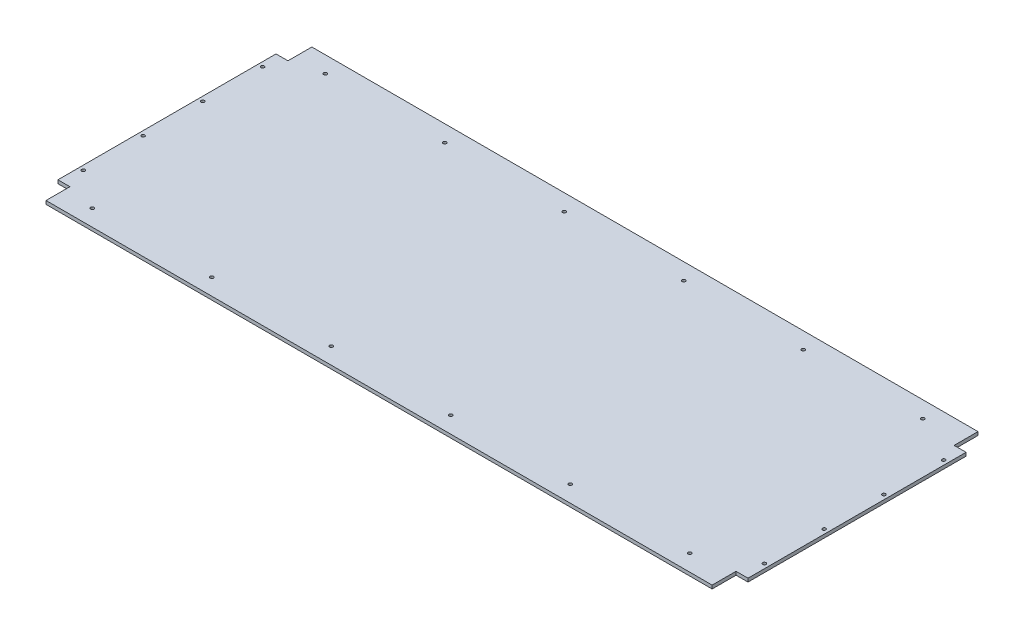
ISO-10303-21;
HEADER;
FILE_DESCRIPTION(('STEP AP214'),'2;1');
FILE_NAME('part.step','',(''),(''),'','','');
FILE_SCHEMA(('AUTOMOTIVE_DESIGN { 1 0 10303 214 1 1 1 1 }'));
ENDSEC;
DATA;
#1=APPLICATION_CONTEXT('core data for automotive mechanical design processes');
#2=APPLICATION_PROTOCOL_DEFINITION('international standard','automotive_design',2000,#1);
#3=PRODUCT_CONTEXT('',#1,'mechanical');
#4=PRODUCT('Part','Part','',(#3));
#5=PRODUCT_RELATED_PRODUCT_CATEGORY('part','',(#4));
#6=PRODUCT_DEFINITION_FORMATION('','',#4);
#7=PRODUCT_DEFINITION_CONTEXT('part definition',#1,'design');
#8=PRODUCT_DEFINITION('design','',#6,#7);
#9=PRODUCT_DEFINITION_SHAPE('','',#8);
#10=(LENGTH_UNIT() NAMED_UNIT(*) SI_UNIT(.MILLI.,.METRE.));
#11=(NAMED_UNIT(*) PLANE_ANGLE_UNIT() SI_UNIT($,.RADIAN.));
#12=(NAMED_UNIT(*) SI_UNIT($,.STERADIAN.) SOLID_ANGLE_UNIT());
#13=UNCERTAINTY_MEASURE_WITH_UNIT(LENGTH_MEASURE(1.E-05),#10,'distance_accuracy_value','');
#14=(GEOMETRIC_REPRESENTATION_CONTEXT(3) GLOBAL_UNCERTAINTY_ASSIGNED_CONTEXT((#13)) GLOBAL_UNIT_ASSIGNED_CONTEXT((#10,
#11,#12)) REPRESENTATION_CONTEXT('',''));
#15=CARTESIAN_POINT('',(0.,0.,0.));
#16=DIRECTION('',(0.,0.,1.));
#17=DIRECTION('',(1.,0.,0.));
#18=AXIS2_PLACEMENT_3D('',#15,#16,#17);
#19=CARTESIAN_POINT('',(-577.5,5.715,-222.5));
#20=DIRECTION('',(1.,0.,0.));
#21=DIRECTION('',(0.,0.,-1.));
#22=AXIS2_PLACEMENT_3D('',#19,#20,#21);
#23=PLANE('',#22);
#24=DIRECTION('',(0.,0.,1.));
#25=VECTOR('',#24,1.);
#26=CARTESIAN_POINT('',(-577.5,0.,-222.5));
#27=LINE('',#26,#25);
#28=CARTESIAN_POINT('',(-577.5,0.,-182.5));
#29=VERTEX_POINT('',#28);
#30=CARTESIAN_POINT('',(-577.5,0.,182.5));
#31=VERTEX_POINT('',#30);
#32=EDGE_CURVE('E144',#29,#31,#27,.T.);
#33=ORIENTED_EDGE('',*,*,#32,.T.);
#34=DIRECTION('',(0.,1.,0.));
#35=VECTOR('',#34,1.);
#36=CARTESIAN_POINT('',(-577.5,0.,182.5));
#37=LINE('',#36,#35);
#38=CARTESIAN_POINT('',(-577.5,5.715,182.5));
#39=VERTEX_POINT('',#38);
#40=EDGE_CURVE('E171',#31,#39,#37,.T.);
#41=ORIENTED_EDGE('',*,*,#40,.T.);
#42=DIRECTION('',(0.,0.,1.));
#43=VECTOR('',#42,1.);
#44=CARTESIAN_POINT('',(-577.5,5.715,-222.5));
#45=LINE('',#44,#43);
#46=CARTESIAN_POINT('',(-577.5,5.715,-182.5));
#47=VERTEX_POINT('',#46);
#48=EDGE_CURVE('E154',#47,#39,#45,.T.);
#49=ORIENTED_EDGE('',*,*,#48,.F.);
#50=DIRECTION('',(0.,1.,0.));
#51=VECTOR('',#50,1.);
#52=CARTESIAN_POINT('',(-577.5,0.,-182.5));
#53=LINE('',#52,#51);
#54=EDGE_CURVE('E157',#29,#47,#53,.T.);
#55=ORIENTED_EDGE('',*,*,#54,.F.);
#56=EDGE_LOOP('',(#33,#41,#49,#55));
#57=FACE_BOUND('',#56,.T.);
#58=ADVANCED_FACE('F33',(#57),#23,.F.);
#59=CARTESIAN_POINT('',(-577.5,5.715,222.5));
#60=DIRECTION('',(0.,0.,-1.));
#61=DIRECTION('',(-1.,0.,0.));
#62=AXIS2_PLACEMENT_3D('',#59,#60,#61);
#63=PLANE('',#62);
#64=DIRECTION('',(1.,0.,0.));
#65=VECTOR('',#64,1.);
#66=CARTESIAN_POINT('',(-577.5,5.715,222.5));
#67=LINE('',#66,#65);
#68=CARTESIAN_POINT('',(-557.5,5.715,222.5));
#69=VERTEX_POINT('',#68);
#70=CARTESIAN_POINT('',(557.5,5.715,222.5));
#71=VERTEX_POINT('',#70);
#72=EDGE_CURVE('E139',#69,#71,#67,.T.);
#73=ORIENTED_EDGE('',*,*,#72,.F.);
#74=DIRECTION('',(0.,1.,0.));
#75=VECTOR('',#74,1.);
#76=CARTESIAN_POINT('',(-557.5,0.,222.5));
#77=LINE('',#76,#75);
#78=CARTESIAN_POINT('',(-557.5,0.,222.5));
#79=VERTEX_POINT('',#78);
#80=EDGE_CURVE('E125',#79,#69,#77,.T.);
#81=ORIENTED_EDGE('',*,*,#80,.F.);
#82=DIRECTION('',(1.,0.,0.));
#83=VECTOR('',#82,1.);
#84=CARTESIAN_POINT('',(-577.5,0.,222.5));
#85=LINE('',#84,#83);
#86=CARTESIAN_POINT('',(557.5,0.,222.5));
#87=VERTEX_POINT('',#86);
#88=EDGE_CURVE('E137',#79,#87,#85,.T.);
#89=ORIENTED_EDGE('',*,*,#88,.T.);
#90=DIRECTION('',(0.,1.,0.));
#91=VECTOR('',#90,1.);
#92=CARTESIAN_POINT('',(557.5,0.,222.5));
#93=LINE('',#92,#91);
#94=EDGE_CURVE('E200',#87,#71,#93,.T.);
#95=ORIENTED_EDGE('',*,*,#94,.T.);
#96=EDGE_LOOP('',(#73,#81,#89,#95));
#97=FACE_BOUND('',#96,.T.);
#98=ADVANCED_FACE('F135',(#97),#63,.F.);
#99=CARTESIAN_POINT('',(577.5,5.715,-222.5));
#100=DIRECTION('',(-1.,0.,0.));
#101=DIRECTION('',(0.,0.,1.));
#102=AXIS2_PLACEMENT_3D('',#99,#100,#101);
#103=PLANE('',#102);
#104=DIRECTION('',(0.,0.,-1.));
#105=VECTOR('',#104,1.);
#106=CARTESIAN_POINT('',(577.5,5.715,-222.5));
#107=LINE('',#106,#105);
#108=CARTESIAN_POINT('',(577.5,5.715,182.5));
#109=VERTEX_POINT('',#108);
#110=CARTESIAN_POINT('',(577.5,5.715,-182.5));
#111=VERTEX_POINT('',#110);
#112=EDGE_CURVE('E41',#109,#111,#107,.T.);
#113=ORIENTED_EDGE('',*,*,#112,.F.);
#114=DIRECTION('',(0.,1.,0.));
#115=VECTOR('',#114,1.);
#116=CARTESIAN_POINT('',(577.5,0.,182.5));
#117=LINE('',#116,#115);
#118=CARTESIAN_POINT('',(577.5,0.,182.5));
#119=VERTEX_POINT('',#118);
#120=EDGE_CURVE('E196',#119,#109,#117,.T.);
#121=ORIENTED_EDGE('',*,*,#120,.F.);
#122=DIRECTION('',(0.,0.,-1.));
#123=VECTOR('',#122,1.);
#124=CARTESIAN_POINT('',(577.5,0.,-222.5));
#125=LINE('',#124,#123);
#126=CARTESIAN_POINT('',(577.5,0.,-182.5));
#127=VERTEX_POINT('',#126);
#128=EDGE_CURVE('E143',#119,#127,#125,.T.);
#129=ORIENTED_EDGE('',*,*,#128,.T.);
#130=DIRECTION('',(0.,1.,0.));
#131=VECTOR('',#130,1.);
#132=CARTESIAN_POINT('',(577.5,0.,-182.5));
#133=LINE('',#132,#131);
#134=EDGE_CURVE('E181',#127,#111,#133,.T.);
#135=ORIENTED_EDGE('',*,*,#134,.T.);
#136=EDGE_LOOP('',(#113,#121,#129,#135));
#137=FACE_BOUND('',#136,.T.);
#138=ADVANCED_FACE('F408',(#137),#103,.F.);
#139=CARTESIAN_POINT('',(-577.5,5.715,-222.5));
#140=DIRECTION('',(0.,0.,1.));
#141=DIRECTION('',(1.,0.,0.));
#142=AXIS2_PLACEMENT_3D('',#139,#140,#141);
#143=PLANE('',#142);
#144=DIRECTION('',(-1.,0.,0.));
#145=VECTOR('',#144,1.);
#146=CARTESIAN_POINT('',(-577.5,5.715,-222.5));
#147=LINE('',#146,#145);
#148=CARTESIAN_POINT('',(557.5,5.715,-222.5));
#149=VERTEX_POINT('',#148);
#150=CARTESIAN_POINT('',(-557.5,5.715,-222.5));
#151=VERTEX_POINT('',#150);
#152=EDGE_CURVE('E11',#149,#151,#147,.T.);
#153=ORIENTED_EDGE('',*,*,#152,.F.);
#154=DIRECTION('',(0.,1.,0.));
#155=VECTOR('',#154,1.);
#156=CARTESIAN_POINT('',(557.5,0.,-222.5));
#157=LINE('',#156,#155);
#158=CARTESIAN_POINT('',(557.5,0.,-222.5));
#159=VERTEX_POINT('',#158);
#160=EDGE_CURVE('E176',#159,#149,#157,.T.);
#161=ORIENTED_EDGE('',*,*,#160,.F.);
#162=DIRECTION('',(-1.,0.,0.));
#163=VECTOR('',#162,1.);
#164=CARTESIAN_POINT('',(-577.5,0.,-222.5));
#165=LINE('',#164,#163);
#166=CARTESIAN_POINT('',(-557.5,0.,-222.5));
#167=VERTEX_POINT('',#166);
#168=EDGE_CURVE('E36',#159,#167,#165,.T.);
#169=ORIENTED_EDGE('',*,*,#168,.T.);
#170=DIRECTION('',(0.,1.,0.));
#171=VECTOR('',#170,1.);
#172=CARTESIAN_POINT('',(-557.5,0.,-222.5));
#173=LINE('',#172,#171);
#174=EDGE_CURVE('E148',#167,#151,#173,.T.);
#175=ORIENTED_EDGE('',*,*,#174,.T.);
#176=EDGE_LOOP('',(#153,#161,#169,#175));
#177=FACE_BOUND('',#176,.T.);
#178=ADVANCED_FACE('F349',(#177),#143,.F.);
#179=CARTESIAN_POINT('',(0.,5.715,0.));
#180=DIRECTION('',(0.,1.,0.));
#181=DIRECTION('',(0.,0.,1.));
#182=AXIS2_PLACEMENT_3D('',#179,#180,#181);
#183=PLANE('',#182);
#184=CARTESIAN_POINT('',(492.5,5.715,195.));
#185=DIRECTION('',(0.,1.,0.));
#186=DIRECTION('',(0.,0.,-1.));
#187=AXIS2_PLACEMENT_3D('',#184,#185,#186);
#188=CIRCLE('',#187,2.75000000000004);
#189=CARTESIAN_POINT('',(492.5,5.715,192.25));
#190=VERTEX_POINT('',#189);
#191=EDGE_CURVE('E301',#190,#190,#188,.T.);
#192=ORIENTED_EDGE('',*,*,#191,.F.);
#193=EDGE_LOOP('',(#192));
#194=FACE_BOUND('',#193,.T.);
#195=CARTESIAN_POINT('',(292.5,5.715,195.));
#196=DIRECTION('',(0.,1.,0.));
#197=DIRECTION('',(0.,0.,-1.));
#198=AXIS2_PLACEMENT_3D('',#195,#196,#197);
#199=CIRCLE('',#198,2.75000000000004);
#200=CARTESIAN_POINT('',(292.5,5.715,192.25));
#201=VERTEX_POINT('',#200);
#202=EDGE_CURVE('E295',#201,#201,#199,.T.);
#203=ORIENTED_EDGE('',*,*,#202,.F.);
#204=EDGE_LOOP('',(#203));
#205=FACE_BOUND('',#204,.T.);
#206=CARTESIAN_POINT('',(92.5,5.715,195.));
#207=DIRECTION('',(0.,1.,0.));
#208=DIRECTION('',(0.,0.,-1.));
#209=AXIS2_PLACEMENT_3D('',#206,#207,#208);
#210=CIRCLE('',#209,2.75000000000002);
#211=CARTESIAN_POINT('',(92.5,5.715,192.25));
#212=VERTEX_POINT('',#211);
#213=EDGE_CURVE('E289',#212,#212,#210,.T.);
#214=ORIENTED_EDGE('',*,*,#213,.F.);
#215=EDGE_LOOP('',(#214));
#216=FACE_BOUND('',#215,.T.);
#217=CARTESIAN_POINT('',(-107.5,5.715,195.));
#218=DIRECTION('',(0.,1.,0.));
#219=DIRECTION('',(0.,0.,-1.));
#220=AXIS2_PLACEMENT_3D('',#217,#218,#219);
#221=CIRCLE('',#220,2.75000000000002);
#222=CARTESIAN_POINT('',(-107.5,5.715,192.25));
#223=VERTEX_POINT('',#222);
#224=EDGE_CURVE('E283',#223,#223,#221,.T.);
#225=ORIENTED_EDGE('',*,*,#224,.F.);
#226=EDGE_LOOP('',(#225));
#227=FACE_BOUND('',#226,.T.);
#228=CARTESIAN_POINT('',(-307.5,5.715,195.));
#229=DIRECTION('',(0.,1.,0.));
#230=DIRECTION('',(0.,0.,-1.));
#231=AXIS2_PLACEMENT_3D('',#228,#229,#230);
#232=CIRCLE('',#231,2.75000000000004);
#233=CARTESIAN_POINT('',(-307.5,5.715,192.25));
#234=VERTEX_POINT('',#233);
#235=EDGE_CURVE('E276',#234,#234,#232,.T.);
#236=ORIENTED_EDGE('',*,*,#235,.F.);
#237=EDGE_LOOP('',(#236));
#238=FACE_BOUND('',#237,.T.);
#239=CARTESIAN_POINT('',(-507.5,5.715,195.));
#240=DIRECTION('',(0.,1.,0.));
#241=DIRECTION('',(0.,0.,-1.));
#242=AXIS2_PLACEMENT_3D('',#239,#240,#241);
#243=CIRCLE('',#242,2.75000000000004);
#244=CARTESIAN_POINT('',(-507.5,5.715,192.25));
#245=VERTEX_POINT('',#244);
#246=EDGE_CURVE('E330',#245,#245,#243,.T.);
#247=ORIENTED_EDGE('',*,*,#246,.F.);
#248=EDGE_LOOP('',(#247));
#249=FACE_BOUND('',#248,.T.);
#250=CARTESIAN_POINT('',(569.999999999997,5.715,147.5));
#251=DIRECTION('',(0.,1.,0.));
#252=DIRECTION('',(0.,0.,-1.));
#253=AXIS2_PLACEMENT_3D('',#250,#251,#252);
#254=CIRCLE('',#253,2.75000000000004);
#255=CARTESIAN_POINT('',(569.999999999997,5.715,144.75));
#256=VERTEX_POINT('',#255);
#257=EDGE_CURVE('E324',#256,#256,#254,.T.);
#258=ORIENTED_EDGE('',*,*,#257,.F.);
#259=EDGE_LOOP('',(#258));
#260=FACE_BOUND('',#259,.T.);
#261=CARTESIAN_POINT('',(569.999999999998,5.715,47.4999999999999));
#262=DIRECTION('',(0.,1.,0.));
#263=DIRECTION('',(0.,0.,-1.));
#264=AXIS2_PLACEMENT_3D('',#261,#262,#263);
#265=CIRCLE('',#264,2.75000000000004);
#266=CARTESIAN_POINT('',(569.999999999998,5.715,44.7499999999999));
#267=VERTEX_POINT('',#266);
#268=EDGE_CURVE('E318',#267,#267,#265,.T.);
#269=ORIENTED_EDGE('',*,*,#268,.F.);
#270=EDGE_LOOP('',(#269));
#271=FACE_BOUND('',#270,.T.);
#272=CARTESIAN_POINT('',(569.999999999999,5.715,-52.5000000000001));
#273=DIRECTION('',(0.,1.,0.));
#274=DIRECTION('',(0.,0.,-1.));
#275=AXIS2_PLACEMENT_3D('',#272,#273,#274);
#276=CIRCLE('',#275,2.75000000000004);
#277=CARTESIAN_POINT('',(569.999999999999,5.715,-55.2500000000001));
#278=VERTEX_POINT('',#277);
#279=EDGE_CURVE('E312',#278,#278,#276,.T.);
#280=ORIENTED_EDGE('',*,*,#279,.F.);
#281=EDGE_LOOP('',(#280));
#282=FACE_BOUND('',#281,.T.);
#283=CARTESIAN_POINT('',(570.,5.715,-152.5));
#284=DIRECTION('',(0.,1.,0.));
#285=DIRECTION('',(0.,0.,-1.));
#286=AXIS2_PLACEMENT_3D('',#283,#284,#285);
#287=CIRCLE('',#286,2.75000000000004);
#288=CARTESIAN_POINT('',(570.,5.715,-155.25));
#289=VERTEX_POINT('',#288);
#290=EDGE_CURVE('E306',#289,#289,#287,.T.);
#291=ORIENTED_EDGE('',*,*,#290,.F.);
#292=EDGE_LOOP('',(#291));
#293=FACE_BOUND('',#292,.T.);
#294=CARTESIAN_POINT('',(-570.,5.715,-152.5));
#295=DIRECTION('',(0.,1.,0.));
#296=DIRECTION('',(0.,0.,1.));
#297=AXIS2_PLACEMENT_3D('',#294,#295,#296);
#298=CIRCLE('',#297,2.75000000000004);
#299=CARTESIAN_POINT('',(-570.,5.715,-149.75));
#300=VERTEX_POINT('',#299);
#301=EDGE_CURVE('E241',#300,#300,#298,.T.);
#302=ORIENTED_EDGE('',*,*,#301,.F.);
#303=EDGE_LOOP('',(#302));
#304=FACE_BOUND('',#303,.T.);
#305=CARTESIAN_POINT('',(-307.5,5.715,-195.));
#306=DIRECTION('',(0.,1.,0.));
#307=DIRECTION('',(0.,0.,1.));
#308=AXIS2_PLACEMENT_3D('',#305,#306,#307);
#309=CIRCLE('',#308,2.75000000000004);
#310=CARTESIAN_POINT('',(-307.5,5.715,-192.25));
#311=VERTEX_POINT('',#310);
#312=EDGE_CURVE('E235',#311,#311,#309,.T.);
#313=ORIENTED_EDGE('',*,*,#312,.F.);
#314=EDGE_LOOP('',(#313));
#315=FACE_BOUND('',#314,.T.);
#316=CARTESIAN_POINT('',(-107.5,5.715,-195.));
#317=DIRECTION('',(0.,1.,0.));
#318=DIRECTION('',(0.,0.,1.));
#319=AXIS2_PLACEMENT_3D('',#316,#317,#318);
#320=CIRCLE('',#319,2.75000000000002);
#321=CARTESIAN_POINT('',(-107.5,5.715,-192.25));
#322=VERTEX_POINT('',#321);
#323=EDGE_CURVE('E229',#322,#322,#320,.T.);
#324=ORIENTED_EDGE('',*,*,#323,.F.);
#325=EDGE_LOOP('',(#324));
#326=FACE_BOUND('',#325,.T.);
#327=CARTESIAN_POINT('',(92.5,5.715,-195.));
#328=DIRECTION('',(0.,1.,0.));
#329=DIRECTION('',(0.,0.,1.));
#330=AXIS2_PLACEMENT_3D('',#327,#328,#329);
#331=CIRCLE('',#330,2.75000000000002);
#332=CARTESIAN_POINT('',(92.5,5.715,-192.25));
#333=VERTEX_POINT('',#332);
#334=EDGE_CURVE('E222',#333,#333,#331,.T.);
#335=ORIENTED_EDGE('',*,*,#334,.F.);
#336=EDGE_LOOP('',(#335));
#337=FACE_BOUND('',#336,.T.);
#338=CARTESIAN_POINT('',(292.5,5.715,-195.));
#339=DIRECTION('',(0.,1.,0.));
#340=DIRECTION('',(0.,0.,1.));
#341=AXIS2_PLACEMENT_3D('',#338,#339,#340);
#342=CIRCLE('',#341,2.75000000000004);
#343=CARTESIAN_POINT('',(292.5,5.715,-192.25));
#344=VERTEX_POINT('',#343);
#345=EDGE_CURVE('E271',#344,#344,#342,.T.);
#346=ORIENTED_EDGE('',*,*,#345,.F.);
#347=EDGE_LOOP('',(#346));
#348=FACE_BOUND('',#347,.T.);
#349=CARTESIAN_POINT('',(492.5,5.715,-195.));
#350=DIRECTION('',(0.,1.,0.));
#351=DIRECTION('',(0.,0.,1.));
#352=AXIS2_PLACEMENT_3D('',#349,#350,#351);
#353=CIRCLE('',#352,2.75000000000004);
#354=CARTESIAN_POINT('',(492.5,5.715,-192.25));
#355=VERTEX_POINT('',#354);
#356=EDGE_CURVE('E265',#355,#355,#353,.T.);
#357=ORIENTED_EDGE('',*,*,#356,.F.);
#358=EDGE_LOOP('',(#357));
#359=FACE_BOUND('',#358,.T.);
#360=CARTESIAN_POINT('',(-569.999999999999,5.715,-52.4999999999999));
#361=DIRECTION('',(0.,1.,0.));
#362=DIRECTION('',(0.,0.,1.));
#363=AXIS2_PLACEMENT_3D('',#360,#361,#362);
#364=CIRCLE('',#363,2.75000000000004);
#365=CARTESIAN_POINT('',(-569.999999999999,5.715,-49.7499999999999));
#366=VERTEX_POINT('',#365);
#367=EDGE_CURVE('E259',#366,#366,#364,.T.);
#368=ORIENTED_EDGE('',*,*,#367,.F.);
#369=EDGE_LOOP('',(#368));
#370=FACE_BOUND('',#369,.T.);
#371=CARTESIAN_POINT('',(-569.999999999998,5.715,47.5000000000001));
#372=DIRECTION('',(0.,1.,0.));
#373=DIRECTION('',(0.,0.,1.));
#374=AXIS2_PLACEMENT_3D('',#371,#372,#373);
#375=CIRCLE('',#374,2.75000000000004);
#376=CARTESIAN_POINT('',(-569.999999999998,5.715,50.2500000000001));
#377=VERTEX_POINT('',#376);
#378=EDGE_CURVE('E253',#377,#377,#375,.T.);
#379=ORIENTED_EDGE('',*,*,#378,.F.);
#380=EDGE_LOOP('',(#379));
#381=FACE_BOUND('',#380,.T.);
#382=CARTESIAN_POINT('',(-569.999999999997,5.715,147.5));
#383=DIRECTION('',(0.,1.,0.));
#384=DIRECTION('',(0.,0.,1.));
#385=AXIS2_PLACEMENT_3D('',#382,#383,#384);
#386=CIRCLE('',#385,2.75000000000004);
#387=CARTESIAN_POINT('',(-569.999999999997,5.715,150.25));
#388=VERTEX_POINT('',#387);
#389=EDGE_CURVE('E246',#388,#388,#386,.T.);
#390=ORIENTED_EDGE('',*,*,#389,.F.);
#391=EDGE_LOOP('',(#390));
#392=FACE_BOUND('',#391,.T.);
#393=CARTESIAN_POINT('',(-507.5,5.715,-195.));
#394=DIRECTION('',(0.,1.,0.));
#395=DIRECTION('',(0.,0.,1.));
#396=AXIS2_PLACEMENT_3D('',#393,#394,#395);
#397=CIRCLE('',#396,2.75000000000004);
#398=CARTESIAN_POINT('',(-507.5,5.715,-192.25));
#399=VERTEX_POINT('',#398);
#400=EDGE_CURVE('E216',#399,#399,#397,.T.);
#401=ORIENTED_EDGE('',*,*,#400,.F.);
#402=EDGE_LOOP('',(#401));
#403=FACE_BOUND('',#402,.T.);
#404=DIRECTION('',(-1.,0.,0.));
#405=VECTOR('',#404,1.);
#406=CARTESIAN_POINT('',(-577.5,5.715,182.5));
#407=LINE('',#406,#405);
#408=CARTESIAN_POINT('',(-557.5,5.715,182.5));
#409=VERTEX_POINT('',#408);
#410=EDGE_CURVE('E130',#409,#39,#407,.T.);
#411=ORIENTED_EDGE('',*,*,#410,.F.);
#412=DIRECTION('',(0.,0.,-1.));
#413=VECTOR('',#412,1.);
#414=CARTESIAN_POINT('',(-557.5,5.715,222.5));
#415=LINE('',#414,#413);
#416=EDGE_CURVE('E202',#69,#409,#415,.T.);
#417=ORIENTED_EDGE('',*,*,#416,.F.);
#418=ORIENTED_EDGE('',*,*,#72,.T.);
#419=DIRECTION('',(0.,0.,1.));
#420=VECTOR('',#419,1.);
#421=CARTESIAN_POINT('',(557.5,5.715,222.5));
#422=LINE('',#421,#420);
#423=CARTESIAN_POINT('',(557.5,5.715,182.5));
#424=VERTEX_POINT('',#423);
#425=EDGE_CURVE('E203',#424,#71,#422,.T.);
#426=ORIENTED_EDGE('',*,*,#425,.F.);
#427=DIRECTION('',(-1.,0.,0.));
#428=VECTOR('',#427,1.);
#429=CARTESIAN_POINT('',(577.5,5.715,182.5));
#430=LINE('',#429,#428);
#431=EDGE_CURVE('E184',#109,#424,#430,.T.);
#432=ORIENTED_EDGE('',*,*,#431,.F.);
#433=ORIENTED_EDGE('',*,*,#112,.T.);
#434=DIRECTION('',(1.,0.,0.));
#435=VECTOR('',#434,1.);
#436=CARTESIAN_POINT('',(577.5,5.715,-182.5));
#437=LINE('',#436,#435);
#438=CARTESIAN_POINT('',(557.5,5.715,-182.5));
#439=VERTEX_POINT('',#438);
#440=EDGE_CURVE('E185',#439,#111,#437,.T.);
#441=ORIENTED_EDGE('',*,*,#440,.F.);
#442=DIRECTION('',(0.,0.,1.));
#443=VECTOR('',#442,1.);
#444=CARTESIAN_POINT('',(557.5,5.715,-222.5));
#445=LINE('',#444,#443);
#446=EDGE_CURVE('E188',#149,#439,#445,.T.);
#447=ORIENTED_EDGE('',*,*,#446,.F.);
#448=ORIENTED_EDGE('',*,*,#152,.T.);
#449=DIRECTION('',(0.,0.,-1.));
#450=VECTOR('',#449,1.);
#451=CARTESIAN_POINT('',(-557.5,5.715,-222.5));
#452=LINE('',#451,#450);
#453=CARTESIAN_POINT('',(-557.5,5.715,-182.5));
#454=VERTEX_POINT('',#453);
#455=EDGE_CURVE('E164',#454,#151,#452,.T.);
#456=ORIENTED_EDGE('',*,*,#455,.F.);
#457=DIRECTION('',(1.,0.,0.));
#458=VECTOR('',#457,1.);
#459=CARTESIAN_POINT('',(-577.5,5.715,-182.5));
#460=LINE('',#459,#458);
#461=EDGE_CURVE('E168',#47,#454,#460,.T.);
#462=ORIENTED_EDGE('',*,*,#461,.F.);
#463=ORIENTED_EDGE('',*,*,#48,.T.);
#464=EDGE_LOOP('',(#411,#417,#418,#426,#432,#433,#441,#447,#448,#456,#462,#463));
#465=FACE_BOUND('',#464,.T.);
#466=ADVANCED_FACE('F346',(#194,#205,#216,#227,#238,#249,#260,#271,#282,#293,#304,#315,#326,
#337,#348,#359,#370,#381,#392,#403,#465),#183,.T.);
#467=CARTESIAN_POINT('',(0.,0.,0.));
#468=DIRECTION('',(0.,1.,0.));
#469=DIRECTION('',(0.,0.,1.));
#470=AXIS2_PLACEMENT_3D('',#467,#468,#469);
#471=PLANE('',#470);
#472=CARTESIAN_POINT('',(492.5,0.,195.));
#473=DIRECTION('',(0.,1.,0.));
#474=DIRECTION('',(0.,0.,-1.));
#475=AXIS2_PLACEMENT_3D('',#472,#473,#474);
#476=CIRCLE('',#475,2.75000000000004);
#477=CARTESIAN_POINT('',(492.5,0.,192.25));
#478=VERTEX_POINT('',#477);
#479=EDGE_CURVE('E250',#478,#478,#476,.T.);
#480=ORIENTED_EDGE('',*,*,#479,.T.);
#481=EDGE_LOOP('',(#480));
#482=FACE_BOUND('',#481,.T.);
#483=CARTESIAN_POINT('',(292.5,0.,195.));
#484=DIRECTION('',(0.,1.,0.));
#485=DIRECTION('',(0.,0.,-1.));
#486=AXIS2_PLACEMENT_3D('',#483,#484,#485);
#487=CIRCLE('',#486,2.75000000000004);
#488=CARTESIAN_POINT('',(292.5,0.,192.25));
#489=VERTEX_POINT('',#488);
#490=EDGE_CURVE('E298',#489,#489,#487,.T.);
#491=ORIENTED_EDGE('',*,*,#490,.T.);
#492=EDGE_LOOP('',(#491));
#493=FACE_BOUND('',#492,.T.);
#494=CARTESIAN_POINT('',(92.5,0.,195.));
#495=DIRECTION('',(0.,1.,0.));
#496=DIRECTION('',(0.,0.,-1.));
#497=AXIS2_PLACEMENT_3D('',#494,#495,#496);
#498=CIRCLE('',#497,2.75000000000002);
#499=CARTESIAN_POINT('',(92.5,0.,192.25));
#500=VERTEX_POINT('',#499);
#501=EDGE_CURVE('E292',#500,#500,#498,.T.);
#502=ORIENTED_EDGE('',*,*,#501,.T.);
#503=EDGE_LOOP('',(#502));
#504=FACE_BOUND('',#503,.T.);
#505=CARTESIAN_POINT('',(-107.5,0.,195.));
#506=DIRECTION('',(0.,1.,0.));
#507=DIRECTION('',(0.,0.,-1.));
#508=AXIS2_PLACEMENT_3D('',#505,#506,#507);
#509=CIRCLE('',#508,2.75000000000002);
#510=CARTESIAN_POINT('',(-107.5,0.,192.25));
#511=VERTEX_POINT('',#510);
#512=EDGE_CURVE('E286',#511,#511,#509,.T.);
#513=ORIENTED_EDGE('',*,*,#512,.T.);
#514=EDGE_LOOP('',(#513));
#515=FACE_BOUND('',#514,.T.);
#516=CARTESIAN_POINT('',(-307.5,0.,195.));
#517=DIRECTION('',(0.,1.,0.));
#518=DIRECTION('',(0.,0.,-1.));
#519=AXIS2_PLACEMENT_3D('',#516,#517,#518);
#520=CIRCLE('',#519,2.75000000000004);
#521=CARTESIAN_POINT('',(-307.5,0.,192.25));
#522=VERTEX_POINT('',#521);
#523=EDGE_CURVE('E279',#522,#522,#520,.T.);
#524=ORIENTED_EDGE('',*,*,#523,.T.);
#525=EDGE_LOOP('',(#524));
#526=FACE_BOUND('',#525,.T.);
#527=CARTESIAN_POINT('',(-507.5,0.,195.));
#528=DIRECTION('',(0.,1.,0.));
#529=DIRECTION('',(0.,0.,-1.));
#530=AXIS2_PLACEMENT_3D('',#527,#528,#529);
#531=CIRCLE('',#530,2.75000000000004);
#532=CARTESIAN_POINT('',(-507.5,0.,192.25));
#533=VERTEX_POINT('',#532);
#534=EDGE_CURVE('E280',#533,#533,#531,.T.);
#535=ORIENTED_EDGE('',*,*,#534,.T.);
#536=EDGE_LOOP('',(#535));
#537=FACE_BOUND('',#536,.T.);
#538=CARTESIAN_POINT('',(569.999999999997,0.,147.5));
#539=DIRECTION('',(0.,1.,0.));
#540=DIRECTION('',(0.,0.,-1.));
#541=AXIS2_PLACEMENT_3D('',#538,#539,#540);
#542=CIRCLE('',#541,2.75000000000004);
#543=CARTESIAN_POINT('',(569.999999999997,0.,144.75));
#544=VERTEX_POINT('',#543);
#545=EDGE_CURVE('E327',#544,#544,#542,.T.);
#546=ORIENTED_EDGE('',*,*,#545,.T.);
#547=EDGE_LOOP('',(#546));
#548=FACE_BOUND('',#547,.T.);
#549=CARTESIAN_POINT('',(569.999999999998,0.,47.4999999999999));
#550=DIRECTION('',(0.,1.,0.));
#551=DIRECTION('',(0.,0.,-1.));
#552=AXIS2_PLACEMENT_3D('',#549,#550,#551);
#553=CIRCLE('',#552,2.75000000000004);
#554=CARTESIAN_POINT('',(569.999999999998,0.,44.7499999999999));
#555=VERTEX_POINT('',#554);
#556=EDGE_CURVE('E321',#555,#555,#553,.T.);
#557=ORIENTED_EDGE('',*,*,#556,.T.);
#558=EDGE_LOOP('',(#557));
#559=FACE_BOUND('',#558,.T.);
#560=CARTESIAN_POINT('',(569.999999999999,0.,-52.5000000000001));
#561=DIRECTION('',(0.,1.,0.));
#562=DIRECTION('',(0.,0.,-1.));
#563=AXIS2_PLACEMENT_3D('',#560,#561,#562);
#564=CIRCLE('',#563,2.75000000000004);
#565=CARTESIAN_POINT('',(569.999999999999,0.,-55.2500000000001));
#566=VERTEX_POINT('',#565);
#567=EDGE_CURVE('E315',#566,#566,#564,.T.);
#568=ORIENTED_EDGE('',*,*,#567,.T.);
#569=EDGE_LOOP('',(#568));
#570=FACE_BOUND('',#569,.T.);
#571=CARTESIAN_POINT('',(570.,0.,-152.5));
#572=DIRECTION('',(0.,1.,0.));
#573=DIRECTION('',(0.,0.,-1.));
#574=AXIS2_PLACEMENT_3D('',#571,#572,#573);
#575=CIRCLE('',#574,2.75000000000004);
#576=CARTESIAN_POINT('',(570.,0.,-155.25));
#577=VERTEX_POINT('',#576);
#578=EDGE_CURVE('E309',#577,#577,#575,.T.);
#579=ORIENTED_EDGE('',*,*,#578,.T.);
#580=EDGE_LOOP('',(#579));
#581=FACE_BOUND('',#580,.T.);
#582=CARTESIAN_POINT('',(-570.,0.,-152.5));
#583=DIRECTION('',(0.,1.,0.));
#584=DIRECTION('',(0.,0.,1.));
#585=AXIS2_PLACEMENT_3D('',#582,#583,#584);
#586=CIRCLE('',#585,2.75000000000004);
#587=CARTESIAN_POINT('',(-570.,0.,-149.75));
#588=VERTEX_POINT('',#587);
#589=EDGE_CURVE('E219',#588,#588,#586,.T.);
#590=ORIENTED_EDGE('',*,*,#589,.T.);
#591=EDGE_LOOP('',(#590));
#592=FACE_BOUND('',#591,.T.);
#593=CARTESIAN_POINT('',(-307.5,0.,-195.));
#594=DIRECTION('',(0.,1.,0.));
#595=DIRECTION('',(0.,0.,1.));
#596=AXIS2_PLACEMENT_3D('',#593,#594,#595);
#597=CIRCLE('',#596,2.75000000000004);
#598=CARTESIAN_POINT('',(-307.5,0.,-192.25));
#599=VERTEX_POINT('',#598);
#600=EDGE_CURVE('E238',#599,#599,#597,.T.);
#601=ORIENTED_EDGE('',*,*,#600,.T.);
#602=EDGE_LOOP('',(#601));
#603=FACE_BOUND('',#602,.T.);
#604=CARTESIAN_POINT('',(-107.5,0.,-195.));
#605=DIRECTION('',(0.,1.,0.));
#606=DIRECTION('',(0.,0.,1.));
#607=AXIS2_PLACEMENT_3D('',#604,#605,#606);
#608=CIRCLE('',#607,2.75000000000002);
#609=CARTESIAN_POINT('',(-107.5,0.,-192.25));
#610=VERTEX_POINT('',#609);
#611=EDGE_CURVE('E232',#610,#610,#608,.T.);
#612=ORIENTED_EDGE('',*,*,#611,.T.);
#613=EDGE_LOOP('',(#612));
#614=FACE_BOUND('',#613,.T.);
#615=CARTESIAN_POINT('',(92.5,0.,-195.));
#616=DIRECTION('',(0.,1.,0.));
#617=DIRECTION('',(0.,0.,1.));
#618=AXIS2_PLACEMENT_3D('',#615,#616,#617);
#619=CIRCLE('',#618,2.75000000000002);
#620=CARTESIAN_POINT('',(92.5,0.,-192.25));
#621=VERTEX_POINT('',#620);
#622=EDGE_CURVE('E225',#621,#621,#619,.T.);
#623=ORIENTED_EDGE('',*,*,#622,.T.);
#624=EDGE_LOOP('',(#623));
#625=FACE_BOUND('',#624,.T.);
#626=CARTESIAN_POINT('',(292.5,0.,-195.));
#627=DIRECTION('',(0.,1.,0.));
#628=DIRECTION('',(0.,0.,1.));
#629=AXIS2_PLACEMENT_3D('',#626,#627,#628);
#630=CIRCLE('',#629,2.75000000000004);
#631=CARTESIAN_POINT('',(292.5,0.,-192.25));
#632=VERTEX_POINT('',#631);
#633=EDGE_CURVE('E226',#632,#632,#630,.T.);
#634=ORIENTED_EDGE('',*,*,#633,.T.);
#635=EDGE_LOOP('',(#634));
#636=FACE_BOUND('',#635,.T.);
#637=CARTESIAN_POINT('',(492.5,0.,-195.));
#638=DIRECTION('',(0.,1.,0.));
#639=DIRECTION('',(0.,0.,1.));
#640=AXIS2_PLACEMENT_3D('',#637,#638,#639);
#641=CIRCLE('',#640,2.75000000000004);
#642=CARTESIAN_POINT('',(492.5,0.,-192.25));
#643=VERTEX_POINT('',#642);
#644=EDGE_CURVE('E268',#643,#643,#641,.T.);
#645=ORIENTED_EDGE('',*,*,#644,.T.);
#646=EDGE_LOOP('',(#645));
#647=FACE_BOUND('',#646,.T.);
#648=CARTESIAN_POINT('',(-569.999999999999,0.,-52.4999999999999));
#649=DIRECTION('',(0.,1.,0.));
#650=DIRECTION('',(0.,0.,1.));
#651=AXIS2_PLACEMENT_3D('',#648,#649,#650);
#652=CIRCLE('',#651,2.75000000000004);
#653=CARTESIAN_POINT('',(-569.999999999999,0.,-49.7499999999999));
#654=VERTEX_POINT('',#653);
#655=EDGE_CURVE('E262',#654,#654,#652,.T.);
#656=ORIENTED_EDGE('',*,*,#655,.T.);
#657=EDGE_LOOP('',(#656));
#658=FACE_BOUND('',#657,.T.);
#659=CARTESIAN_POINT('',(-569.999999999998,0.,47.5000000000001));
#660=DIRECTION('',(0.,1.,0.));
#661=DIRECTION('',(0.,0.,1.));
#662=AXIS2_PLACEMENT_3D('',#659,#660,#661);
#663=CIRCLE('',#662,2.75000000000004);
#664=CARTESIAN_POINT('',(-569.999999999998,0.,50.2500000000001));
#665=VERTEX_POINT('',#664);
#666=EDGE_CURVE('E256',#665,#665,#663,.T.);
#667=ORIENTED_EDGE('',*,*,#666,.T.);
#668=EDGE_LOOP('',(#667));
#669=FACE_BOUND('',#668,.T.);
#670=CARTESIAN_POINT('',(-569.999999999997,0.,147.5));
#671=DIRECTION('',(0.,1.,0.));
#672=DIRECTION('',(0.,0.,1.));
#673=AXIS2_PLACEMENT_3D('',#670,#671,#672);
#674=CIRCLE('',#673,2.75000000000004);
#675=CARTESIAN_POINT('',(-569.999999999997,0.,150.25));
#676=VERTEX_POINT('',#675);
#677=EDGE_CURVE('E249',#676,#676,#674,.T.);
#678=ORIENTED_EDGE('',*,*,#677,.T.);
#679=EDGE_LOOP('',(#678));
#680=FACE_BOUND('',#679,.T.);
#681=CARTESIAN_POINT('',(-507.5,0.,-195.));
#682=DIRECTION('',(0.,1.,0.));
#683=DIRECTION('',(0.,0.,1.));
#684=AXIS2_PLACEMENT_3D('',#681,#682,#683);
#685=CIRCLE('',#684,2.75000000000004);
#686=CARTESIAN_POINT('',(-507.5,0.,-192.25));
#687=VERTEX_POINT('',#686);
#688=EDGE_CURVE('E191',#687,#687,#685,.T.);
#689=ORIENTED_EDGE('',*,*,#688,.T.);
#690=EDGE_LOOP('',(#689));
#691=FACE_BOUND('',#690,.T.);
#692=DIRECTION('',(0.,0.,-1.));
#693=VECTOR('',#692,1.);
#694=CARTESIAN_POINT('',(-557.5,0.,222.5));
#695=LINE('',#694,#693);
#696=CARTESIAN_POINT('',(-557.5,0.,182.5));
#697=VERTEX_POINT('',#696);
#698=EDGE_CURVE('E121',#79,#697,#695,.T.);
#699=ORIENTED_EDGE('',*,*,#698,.T.);
#700=DIRECTION('',(-1.,0.,0.));
#701=VECTOR('',#700,1.);
#702=CARTESIAN_POINT('',(-577.5,0.,182.5));
#703=LINE('',#702,#701);
#704=EDGE_CURVE('E49',#697,#31,#703,.T.);
#705=ORIENTED_EDGE('',*,*,#704,.T.);
#706=ORIENTED_EDGE('',*,*,#32,.F.);
#707=DIRECTION('',(1.,0.,0.));
#708=VECTOR('',#707,1.);
#709=CARTESIAN_POINT('',(-577.5,0.,-182.5));
#710=LINE('',#709,#708);
#711=CARTESIAN_POINT('',(-557.5,0.,-182.5));
#712=VERTEX_POINT('',#711);
#713=EDGE_CURVE('E167',#29,#712,#710,.T.);
#714=ORIENTED_EDGE('',*,*,#713,.T.);
#715=DIRECTION('',(0.,0.,-1.));
#716=VECTOR('',#715,1.);
#717=CARTESIAN_POINT('',(-557.5,0.,-222.5));
#718=LINE('',#717,#716);
#719=EDGE_CURVE('E160',#712,#167,#718,.T.);
#720=ORIENTED_EDGE('',*,*,#719,.T.);
#721=ORIENTED_EDGE('',*,*,#168,.F.);
#722=DIRECTION('',(0.,0.,1.));
#723=VECTOR('',#722,1.);
#724=CARTESIAN_POINT('',(557.5,0.,-222.5));
#725=LINE('',#724,#723);
#726=CARTESIAN_POINT('',(557.5,0.,-182.5));
#727=VERTEX_POINT('',#726);
#728=EDGE_CURVE('E187',#159,#727,#725,.T.);
#729=ORIENTED_EDGE('',*,*,#728,.T.);
#730=DIRECTION('',(1.,0.,0.));
#731=VECTOR('',#730,1.);
#732=CARTESIAN_POINT('',(577.5,0.,-182.5));
#733=LINE('',#732,#731);
#734=EDGE_CURVE('E179',#727,#127,#733,.T.);
#735=ORIENTED_EDGE('',*,*,#734,.T.);
#736=ORIENTED_EDGE('',*,*,#128,.F.);
#737=DIRECTION('',(-1.,0.,0.));
#738=VECTOR('',#737,1.);
#739=CARTESIAN_POINT('',(577.5,0.,182.5));
#740=LINE('',#739,#738);
#741=CARTESIAN_POINT('',(557.5,0.,182.5));
#742=VERTEX_POINT('',#741);
#743=EDGE_CURVE('E205',#119,#742,#740,.T.);
#744=ORIENTED_EDGE('',*,*,#743,.T.);
#745=DIRECTION('',(0.,0.,1.));
#746=VECTOR('',#745,1.);
#747=CARTESIAN_POINT('',(557.5,0.,222.5));
#748=LINE('',#747,#746);
#749=EDGE_CURVE('E57',#742,#87,#748,.T.);
#750=ORIENTED_EDGE('',*,*,#749,.T.);
#751=ORIENTED_EDGE('',*,*,#88,.F.);
#752=EDGE_LOOP('',(#699,#705,#706,#714,#720,#721,#729,#735,#736,#744,#750,#751));
#753=FACE_BOUND('',#752,.T.);
#754=ADVANCED_FACE('F141',(#482,#493,#504,#515,#526,#537,#548,#559,#570,#581,#592,#603,#614,
#625,#636,#647,#658,#669,#680,#691,#753),#471,.F.);
#755=CARTESIAN_POINT('',(-557.5,0.,-222.5));
#756=DIRECTION('',(1.,0.,0.));
#757=DIRECTION('',(0.,0.,-1.));
#758=AXIS2_PLACEMENT_3D('',#755,#756,#757);
#759=PLANE('',#758);
#760=ORIENTED_EDGE('',*,*,#455,.T.);
#761=ORIENTED_EDGE('',*,*,#174,.F.);
#762=ORIENTED_EDGE('',*,*,#719,.F.);
#763=DIRECTION('',(0.,1.,0.));
#764=VECTOR('',#763,1.);
#765=CARTESIAN_POINT('',(-557.5,0.,-182.5));
#766=LINE('',#765,#764);
#767=EDGE_CURVE('E159',#712,#454,#766,.T.);
#768=ORIENTED_EDGE('',*,*,#767,.T.);
#769=EDGE_LOOP('',(#760,#761,#762,#768));
#770=FACE_BOUND('',#769,.T.);
#771=ADVANCED_FACE('F393',(#770),#759,.F.);
#772=CARTESIAN_POINT('',(-577.5,0.,-182.5));
#773=DIRECTION('',(0.,0.,1.));
#774=DIRECTION('',(1.,0.,0.));
#775=AXIS2_PLACEMENT_3D('',#772,#773,#774);
#776=PLANE('',#775);
#777=ORIENTED_EDGE('',*,*,#461,.T.);
#778=ORIENTED_EDGE('',*,*,#767,.F.);
#779=ORIENTED_EDGE('',*,*,#713,.F.);
#780=ORIENTED_EDGE('',*,*,#54,.T.);
#781=EDGE_LOOP('',(#777,#778,#779,#780));
#782=FACE_BOUND('',#781,.T.);
#783=ADVANCED_FACE('F390',(#782),#776,.F.);
#784=CARTESIAN_POINT('',(577.5,0.,-182.5));
#785=DIRECTION('',(0.,0.,1.));
#786=DIRECTION('',(1.,0.,0.));
#787=AXIS2_PLACEMENT_3D('',#784,#785,#786);
#788=PLANE('',#787);
#789=ORIENTED_EDGE('',*,*,#440,.T.);
#790=ORIENTED_EDGE('',*,*,#134,.F.);
#791=ORIENTED_EDGE('',*,*,#734,.F.);
#792=DIRECTION('',(0.,1.,0.));
#793=VECTOR('',#792,1.);
#794=CARTESIAN_POINT('',(557.5,0.,-182.5));
#795=LINE('',#794,#793);
#796=EDGE_CURVE('E178',#727,#439,#795,.T.);
#797=ORIENTED_EDGE('',*,*,#796,.T.);
#798=EDGE_LOOP('',(#789,#790,#791,#797));
#799=FACE_BOUND('',#798,.T.);
#800=ADVANCED_FACE('F405',(#799),#788,.F.);
#801=CARTESIAN_POINT('',(557.5,0.,-222.5));
#802=DIRECTION('',(-1.,0.,0.));
#803=DIRECTION('',(0.,0.,1.));
#804=AXIS2_PLACEMENT_3D('',#801,#802,#803);
#805=PLANE('',#804);
#806=ORIENTED_EDGE('',*,*,#446,.T.);
#807=ORIENTED_EDGE('',*,*,#796,.F.);
#808=ORIENTED_EDGE('',*,*,#728,.F.);
#809=ORIENTED_EDGE('',*,*,#160,.T.);
#810=EDGE_LOOP('',(#806,#807,#808,#809));
#811=FACE_BOUND('',#810,.T.);
#812=ADVANCED_FACE('F401',(#811),#805,.F.);
#813=CARTESIAN_POINT('',(557.5,0.,222.5));
#814=DIRECTION('',(-1.,0.,0.));
#815=DIRECTION('',(0.,0.,1.));
#816=AXIS2_PLACEMENT_3D('',#813,#814,#815);
#817=PLANE('',#816);
#818=ORIENTED_EDGE('',*,*,#425,.T.);
#819=ORIENTED_EDGE('',*,*,#94,.F.);
#820=ORIENTED_EDGE('',*,*,#749,.F.);
#821=DIRECTION('',(0.,1.,0.));
#822=VECTOR('',#821,1.);
#823=CARTESIAN_POINT('',(557.5,0.,182.5));
#824=LINE('',#823,#822);
#825=EDGE_CURVE('E198',#742,#424,#824,.T.);
#826=ORIENTED_EDGE('',*,*,#825,.T.);
#827=EDGE_LOOP('',(#818,#819,#820,#826));
#828=FACE_BOUND('',#827,.T.);
#829=ADVANCED_FACE('F414',(#828),#817,.F.);
#830=CARTESIAN_POINT('',(577.5,0.,182.5));
#831=DIRECTION('',(0.,0.,-1.));
#832=DIRECTION('',(-1.,0.,0.));
#833=AXIS2_PLACEMENT_3D('',#830,#831,#832);
#834=PLANE('',#833);
#835=ORIENTED_EDGE('',*,*,#431,.T.);
#836=ORIENTED_EDGE('',*,*,#825,.F.);
#837=ORIENTED_EDGE('',*,*,#743,.F.);
#838=ORIENTED_EDGE('',*,*,#120,.T.);
#839=EDGE_LOOP('',(#835,#836,#837,#838));
#840=FACE_BOUND('',#839,.T.);
#841=ADVANCED_FACE('F413',(#840),#834,.F.);
#842=CARTESIAN_POINT('',(-577.5,0.,182.5));
#843=DIRECTION('',(0.,0.,-1.));
#844=DIRECTION('',(-1.,0.,0.));
#845=AXIS2_PLACEMENT_3D('',#842,#843,#844);
#846=PLANE('',#845);
#847=ORIENTED_EDGE('',*,*,#410,.T.);
#848=ORIENTED_EDGE('',*,*,#40,.F.);
#849=ORIENTED_EDGE('',*,*,#704,.F.);
#850=DIRECTION('',(0.,1.,0.));
#851=VECTOR('',#850,1.);
#852=CARTESIAN_POINT('',(-557.5,0.,182.5));
#853=LINE('',#852,#851);
#854=EDGE_CURVE('E127',#697,#409,#853,.T.);
#855=ORIENTED_EDGE('',*,*,#854,.T.);
#856=EDGE_LOOP('',(#847,#848,#849,#855));
#857=FACE_BOUND('',#856,.T.);
#858=ADVANCED_FACE('F383',(#857),#846,.F.);
#859=CARTESIAN_POINT('',(-557.5,0.,222.5));
#860=DIRECTION('',(1.,0.,0.));
#861=DIRECTION('',(0.,0.,-1.));
#862=AXIS2_PLACEMENT_3D('',#859,#860,#861);
#863=PLANE('',#862);
#864=ORIENTED_EDGE('',*,*,#416,.T.);
#865=ORIENTED_EDGE('',*,*,#854,.F.);
#866=ORIENTED_EDGE('',*,*,#698,.F.);
#867=ORIENTED_EDGE('',*,*,#80,.T.);
#868=EDGE_LOOP('',(#864,#865,#866,#867));
#869=FACE_BOUND('',#868,.T.);
#870=ADVANCED_FACE('F124',(#869),#863,.F.);
#871=CARTESIAN_POINT('',(-507.5,0.,-195.));
#872=DIRECTION('',(0.,1.,0.));
#873=DIRECTION('',(0.,0.,1.));
#874=AXIS2_PLACEMENT_3D('',#871,#872,#873);
#875=CYLINDRICAL_SURFACE('',#874,2.75000000000004);
#876=ORIENTED_EDGE('',*,*,#688,.F.);
#877=EDGE_LOOP('',(#876));
#878=FACE_BOUND('',#877,.T.);
#879=ORIENTED_EDGE('',*,*,#400,.T.);
#880=EDGE_LOOP('',(#879));
#881=FACE_BOUND('',#880,.T.);
#882=ADVANCED_FACE('F478',(#878,#881),#875,.F.);
#883=CARTESIAN_POINT('',(-569.999999999997,0.,147.5));
#884=DIRECTION('',(0.,1.,0.));
#885=DIRECTION('',(0.,0.,1.));
#886=AXIS2_PLACEMENT_3D('',#883,#884,#885);
#887=CYLINDRICAL_SURFACE('',#886,2.75000000000004);
#888=ORIENTED_EDGE('',*,*,#677,.F.);
#889=EDGE_LOOP('',(#888));
#890=FACE_BOUND('',#889,.T.);
#891=ORIENTED_EDGE('',*,*,#389,.T.);
#892=EDGE_LOOP('',(#891));
#893=FACE_BOUND('',#892,.T.);
#894=ADVANCED_FACE('F500',(#890,#893),#887,.F.);
#895=CARTESIAN_POINT('',(-569.999999999998,0.,47.5000000000001));
#896=DIRECTION('',(0.,1.,0.));
#897=DIRECTION('',(0.,0.,1.));
#898=AXIS2_PLACEMENT_3D('',#895,#896,#897);
#899=CYLINDRICAL_SURFACE('',#898,2.75000000000004);
#900=ORIENTED_EDGE('',*,*,#666,.F.);
#901=EDGE_LOOP('',(#900));
#902=FACE_BOUND('',#901,.T.);
#903=ORIENTED_EDGE('',*,*,#378,.T.);
#904=EDGE_LOOP('',(#903));
#905=FACE_BOUND('',#904,.T.);
#906=ADVANCED_FACE('F510',(#902,#905),#899,.F.);
#907=CARTESIAN_POINT('',(-569.999999999999,0.,-52.4999999999999));
#908=DIRECTION('',(0.,1.,0.));
#909=DIRECTION('',(0.,0.,1.));
#910=AXIS2_PLACEMENT_3D('',#907,#908,#909);
#911=CYLINDRICAL_SURFACE('',#910,2.75000000000004);
#912=ORIENTED_EDGE('',*,*,#655,.F.);
#913=EDGE_LOOP('',(#912));
#914=FACE_BOUND('',#913,.T.);
#915=ORIENTED_EDGE('',*,*,#367,.T.);
#916=EDGE_LOOP('',(#915));
#917=FACE_BOUND('',#916,.T.);
#918=ADVANCED_FACE('F520',(#914,#917),#911,.F.);
#919=CARTESIAN_POINT('',(492.5,0.,-195.));
#920=DIRECTION('',(0.,1.,0.));
#921=DIRECTION('',(0.,0.,1.));
#922=AXIS2_PLACEMENT_3D('',#919,#920,#921);
#923=CYLINDRICAL_SURFACE('',#922,2.75000000000004);
#924=ORIENTED_EDGE('',*,*,#644,.F.);
#925=EDGE_LOOP('',(#924));
#926=FACE_BOUND('',#925,.T.);
#927=ORIENTED_EDGE('',*,*,#356,.T.);
#928=EDGE_LOOP('',(#927));
#929=FACE_BOUND('',#928,.T.);
#930=ADVANCED_FACE('F530',(#926,#929),#923,.F.);
#931=CARTESIAN_POINT('',(292.5,0.,-195.));
#932=DIRECTION('',(0.,1.,0.));
#933=DIRECTION('',(0.,0.,1.));
#934=AXIS2_PLACEMENT_3D('',#931,#932,#933);
#935=CYLINDRICAL_SURFACE('',#934,2.75000000000004);
#936=ORIENTED_EDGE('',*,*,#633,.F.);
#937=EDGE_LOOP('',(#936));
#938=FACE_BOUND('',#937,.T.);
#939=ORIENTED_EDGE('',*,*,#345,.T.);
#940=EDGE_LOOP('',(#939));
#941=FACE_BOUND('',#940,.T.);
#942=ADVANCED_FACE('F540',(#938,#941),#935,.F.);
#943=CARTESIAN_POINT('',(92.5,0.,-195.));
#944=DIRECTION('',(0.,1.,0.));
#945=DIRECTION('',(0.,0.,1.));
#946=AXIS2_PLACEMENT_3D('',#943,#944,#945);
#947=CYLINDRICAL_SURFACE('',#946,2.75000000000002);
#948=ORIENTED_EDGE('',*,*,#622,.F.);
#949=EDGE_LOOP('',(#948));
#950=FACE_BOUND('',#949,.T.);
#951=ORIENTED_EDGE('',*,*,#334,.T.);
#952=EDGE_LOOP('',(#951));
#953=FACE_BOUND('',#952,.T.);
#954=ADVANCED_FACE('F550',(#950,#953),#947,.F.);
#955=CARTESIAN_POINT('',(-107.5,0.,-195.));
#956=DIRECTION('',(0.,1.,0.));
#957=DIRECTION('',(0.,0.,1.));
#958=AXIS2_PLACEMENT_3D('',#955,#956,#957);
#959=CYLINDRICAL_SURFACE('',#958,2.75000000000002);
#960=ORIENTED_EDGE('',*,*,#611,.F.);
#961=EDGE_LOOP('',(#960));
#962=FACE_BOUND('',#961,.T.);
#963=ORIENTED_EDGE('',*,*,#323,.T.);
#964=EDGE_LOOP('',(#963));
#965=FACE_BOUND('',#964,.T.);
#966=ADVANCED_FACE('F560',(#962,#965),#959,.F.);
#967=CARTESIAN_POINT('',(-307.5,0.,-195.));
#968=DIRECTION('',(0.,1.,0.));
#969=DIRECTION('',(0.,0.,1.));
#970=AXIS2_PLACEMENT_3D('',#967,#968,#969);
#971=CYLINDRICAL_SURFACE('',#970,2.75000000000004);
#972=ORIENTED_EDGE('',*,*,#600,.F.);
#973=EDGE_LOOP('',(#972));
#974=FACE_BOUND('',#973,.T.);
#975=ORIENTED_EDGE('',*,*,#312,.T.);
#976=EDGE_LOOP('',(#975));
#977=FACE_BOUND('',#976,.T.);
#978=ADVANCED_FACE('F570',(#974,#977),#971,.F.);
#979=CARTESIAN_POINT('',(-570.,0.,-152.5));
#980=DIRECTION('',(0.,1.,0.));
#981=DIRECTION('',(0.,0.,1.));
#982=AXIS2_PLACEMENT_3D('',#979,#980,#981);
#983=CYLINDRICAL_SURFACE('',#982,2.75000000000004);
#984=ORIENTED_EDGE('',*,*,#589,.F.);
#985=EDGE_LOOP('',(#984));
#986=FACE_BOUND('',#985,.T.);
#987=ORIENTED_EDGE('',*,*,#301,.T.);
#988=EDGE_LOOP('',(#987));
#989=FACE_BOUND('',#988,.T.);
#990=ADVANCED_FACE('F580',(#986,#989),#983,.F.);
#991=CARTESIAN_POINT('',(570.,0.,-152.5));
#992=DIRECTION('',(0.,1.,0.));
#993=DIRECTION('',(0.,0.,1.));
#994=AXIS2_PLACEMENT_3D('',#991,#992,#993);
#995=CYLINDRICAL_SURFACE('',#994,2.75000000000004);
#996=ORIENTED_EDGE('',*,*,#578,.F.);
#997=EDGE_LOOP('',(#996));
#998=FACE_BOUND('',#997,.T.);
#999=ORIENTED_EDGE('',*,*,#290,.T.);
#1000=EDGE_LOOP('',(#999));
#1001=FACE_BOUND('',#1000,.T.);
#1002=ADVANCED_FACE('F590',(#998,#1001),#995,.F.);
#1003=CARTESIAN_POINT('',(569.999999999999,0.,-52.5000000000001));
#1004=DIRECTION('',(0.,1.,0.));
#1005=DIRECTION('',(0.,0.,1.));
#1006=AXIS2_PLACEMENT_3D('',#1003,#1004,#1005);
#1007=CYLINDRICAL_SURFACE('',#1006,2.75000000000004);
#1008=ORIENTED_EDGE('',*,*,#567,.F.);
#1009=EDGE_LOOP('',(#1008));
#1010=FACE_BOUND('',#1009,.T.);
#1011=ORIENTED_EDGE('',*,*,#279,.T.);
#1012=EDGE_LOOP('',(#1011));
#1013=FACE_BOUND('',#1012,.T.);
#1014=ADVANCED_FACE('F600',(#1010,#1013),#1007,.F.);
#1015=CARTESIAN_POINT('',(569.999999999998,0.,47.4999999999999));
#1016=DIRECTION('',(0.,1.,0.));
#1017=DIRECTION('',(0.,0.,1.));
#1018=AXIS2_PLACEMENT_3D('',#1015,#1016,#1017);
#1019=CYLINDRICAL_SURFACE('',#1018,2.75000000000004);
#1020=ORIENTED_EDGE('',*,*,#556,.F.);
#1021=EDGE_LOOP('',(#1020));
#1022=FACE_BOUND('',#1021,.T.);
#1023=ORIENTED_EDGE('',*,*,#268,.T.);
#1024=EDGE_LOOP('',(#1023));
#1025=FACE_BOUND('',#1024,.T.);
#1026=ADVANCED_FACE('F610',(#1022,#1025),#1019,.F.);
#1027=CARTESIAN_POINT('',(569.999999999997,0.,147.5));
#1028=DIRECTION('',(0.,1.,0.));
#1029=DIRECTION('',(0.,0.,1.));
#1030=AXIS2_PLACEMENT_3D('',#1027,#1028,#1029);
#1031=CYLINDRICAL_SURFACE('',#1030,2.75000000000004);
#1032=ORIENTED_EDGE('',*,*,#545,.F.);
#1033=EDGE_LOOP('',(#1032));
#1034=FACE_BOUND('',#1033,.T.);
#1035=ORIENTED_EDGE('',*,*,#257,.T.);
#1036=EDGE_LOOP('',(#1035));
#1037=FACE_BOUND('',#1036,.T.);
#1038=ADVANCED_FACE('F342',(#1034,#1037),#1031,.F.);
#1039=CARTESIAN_POINT('',(-507.5,0.,195.));
#1040=DIRECTION('',(0.,1.,0.));
#1041=DIRECTION('',(0.,0.,1.));
#1042=AXIS2_PLACEMENT_3D('',#1039,#1040,#1041);
#1043=CYLINDRICAL_SURFACE('',#1042,2.75000000000004);
#1044=ORIENTED_EDGE('',*,*,#534,.F.);
#1045=EDGE_LOOP('',(#1044));
#1046=FACE_BOUND('',#1045,.T.);
#1047=ORIENTED_EDGE('',*,*,#246,.T.);
#1048=EDGE_LOOP('',(#1047));
#1049=FACE_BOUND('',#1048,.T.);
#1050=ADVANCED_FACE('F338',(#1046,#1049),#1043,.F.);
#1051=CARTESIAN_POINT('',(-307.5,0.,195.));
#1052=DIRECTION('',(0.,1.,0.));
#1053=DIRECTION('',(0.,0.,1.));
#1054=AXIS2_PLACEMENT_3D('',#1051,#1052,#1053);
#1055=CYLINDRICAL_SURFACE('',#1054,2.75000000000004);
#1056=ORIENTED_EDGE('',*,*,#523,.F.);
#1057=EDGE_LOOP('',(#1056));
#1058=FACE_BOUND('',#1057,.T.);
#1059=ORIENTED_EDGE('',*,*,#235,.T.);
#1060=EDGE_LOOP('',(#1059));
#1061=FACE_BOUND('',#1060,.T.);
#1062=ADVANCED_FACE('F341',(#1058,#1061),#1055,.F.);
#1063=CARTESIAN_POINT('',(-107.5,0.,195.));
#1064=DIRECTION('',(0.,1.,0.));
#1065=DIRECTION('',(0.,0.,1.));
#1066=AXIS2_PLACEMENT_3D('',#1063,#1064,#1065);
#1067=CYLINDRICAL_SURFACE('',#1066,2.75000000000002);
#1068=ORIENTED_EDGE('',*,*,#512,.F.);
#1069=EDGE_LOOP('',(#1068));
#1070=FACE_BOUND('',#1069,.T.);
#1071=ORIENTED_EDGE('',*,*,#224,.T.);
#1072=EDGE_LOOP('',(#1071));
#1073=FACE_BOUND('',#1072,.T.);
#1074=ADVANCED_FACE('F644',(#1070,#1073),#1067,.F.);
#1075=CARTESIAN_POINT('',(92.5,0.,195.));
#1076=DIRECTION('',(0.,1.,0.));
#1077=DIRECTION('',(0.,0.,1.));
#1078=AXIS2_PLACEMENT_3D('',#1075,#1076,#1077);
#1079=CYLINDRICAL_SURFACE('',#1078,2.75000000000002);
#1080=ORIENTED_EDGE('',*,*,#501,.F.);
#1081=EDGE_LOOP('',(#1080));
#1082=FACE_BOUND('',#1081,.T.);
#1083=ORIENTED_EDGE('',*,*,#213,.T.);
#1084=EDGE_LOOP('',(#1083));
#1085=FACE_BOUND('',#1084,.T.);
#1086=ADVANCED_FACE('F654',(#1082,#1085),#1079,.F.);
#1087=CARTESIAN_POINT('',(292.5,0.,195.));
#1088=DIRECTION('',(0.,1.,0.));
#1089=DIRECTION('',(0.,0.,1.));
#1090=AXIS2_PLACEMENT_3D('',#1087,#1088,#1089);
#1091=CYLINDRICAL_SURFACE('',#1090,2.75000000000004);
#1092=ORIENTED_EDGE('',*,*,#490,.F.);
#1093=EDGE_LOOP('',(#1092));
#1094=FACE_BOUND('',#1093,.T.);
#1095=ORIENTED_EDGE('',*,*,#202,.T.);
#1096=EDGE_LOOP('',(#1095));
#1097=FACE_BOUND('',#1096,.T.);
#1098=ADVANCED_FACE('F664',(#1094,#1097),#1091,.F.);
#1099=CARTESIAN_POINT('',(492.5,0.,195.));
#1100=DIRECTION('',(0.,1.,0.));
#1101=DIRECTION('',(0.,0.,1.));
#1102=AXIS2_PLACEMENT_3D('',#1099,#1100,#1101);
#1103=CYLINDRICAL_SURFACE('',#1102,2.75000000000004);
#1104=ORIENTED_EDGE('',*,*,#479,.F.);
#1105=EDGE_LOOP('',(#1104));
#1106=FACE_BOUND('',#1105,.T.);
#1107=ORIENTED_EDGE('',*,*,#191,.T.);
#1108=EDGE_LOOP('',(#1107));
#1109=FACE_BOUND('',#1108,.T.);
#1110=ADVANCED_FACE('F674',(#1106,#1109),#1103,.F.);
#1111=CLOSED_SHELL('',(#58,#98,#138,#178,#466,#754,#771,#783,#800,#812,#829,#841,#858,#870,#882,
#894,#906,#918,#930,#942,#954,#966,#978,#990,#1002,#1014,#1026,#1038,#1050,#1062,#1074,#1086,
#1098,#1110));
#1112=MANIFOLD_SOLID_BREP('B2',#1111);
#1113=ADVANCED_BREP_SHAPE_REPRESENTATION('',(#18,#1112),#14);
#1114=SHAPE_DEFINITION_REPRESENTATION(#9,#1113);
ENDSEC;
END-ISO-10303-21;
